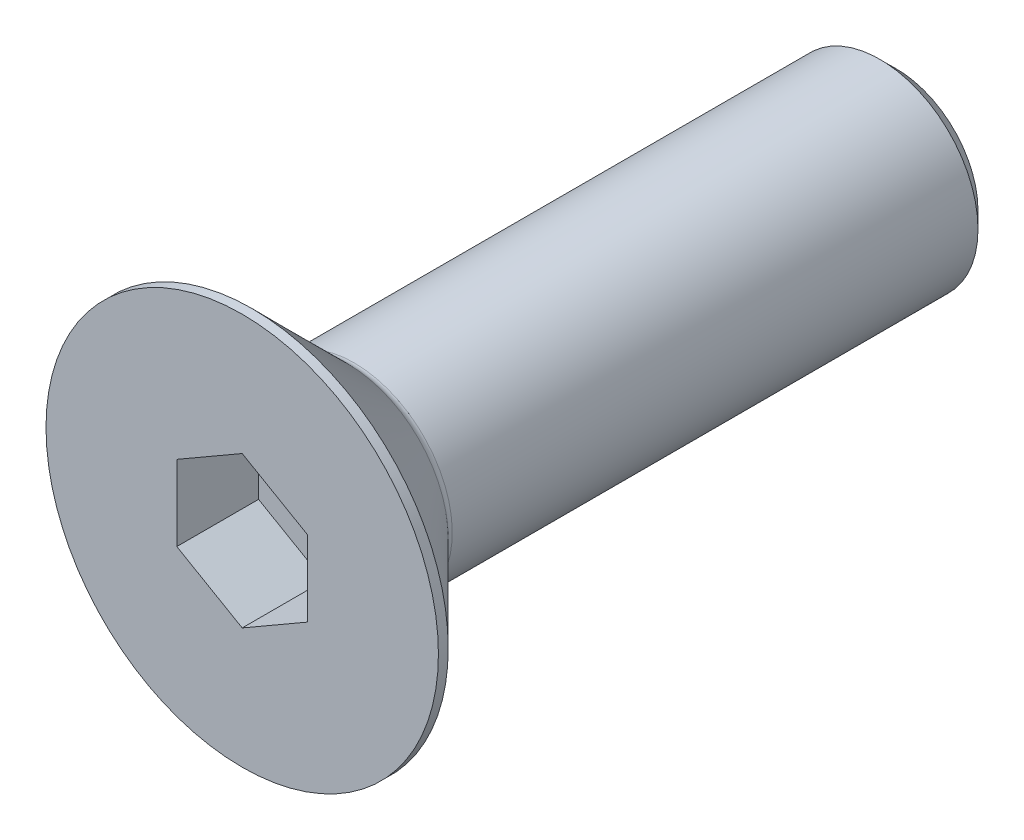
ISO-10303-21;
HEADER;
FILE_DESCRIPTION(('STEP AP214'),'2;1');
FILE_NAME('part.step','',(''),(''),'','','');
FILE_SCHEMA(('AUTOMOTIVE_DESIGN { 1 0 10303 214 1 1 1 1 }'));
ENDSEC;
DATA;
#1=APPLICATION_CONTEXT('core data for automotive mechanical design processes');
#2=APPLICATION_PROTOCOL_DEFINITION('international standard','automotive_design',2000,#1);
#3=PRODUCT_CONTEXT('',#1,'mechanical');
#4=PRODUCT('Part','Part','',(#3));
#5=PRODUCT_RELATED_PRODUCT_CATEGORY('part','',(#4));
#6=PRODUCT_DEFINITION_FORMATION('','',#4);
#7=PRODUCT_DEFINITION_CONTEXT('part definition',#1,'design');
#8=PRODUCT_DEFINITION('design','',#6,#7);
#9=PRODUCT_DEFINITION_SHAPE('','',#8);
#10=(LENGTH_UNIT() NAMED_UNIT(*) SI_UNIT(.MILLI.,.METRE.));
#11=(NAMED_UNIT(*) PLANE_ANGLE_UNIT() SI_UNIT($,.RADIAN.));
#12=(NAMED_UNIT(*) SI_UNIT($,.STERADIAN.) SOLID_ANGLE_UNIT());
#13=UNCERTAINTY_MEASURE_WITH_UNIT(LENGTH_MEASURE(1.E-05),#10,'distance_accuracy_value','');
#14=(GEOMETRIC_REPRESENTATION_CONTEXT(3) GLOBAL_UNCERTAINTY_ASSIGNED_CONTEXT((#13)) GLOBAL_UNIT_ASSIGNED_CONTEXT((#10,
#11,#12)) REPRESENTATION_CONTEXT('',''));
#15=CARTESIAN_POINT('',(0.,0.,0.));
#16=DIRECTION('',(0.,0.,1.));
#17=DIRECTION('',(1.,0.,0.));
#18=AXIS2_PLACEMENT_3D('',#15,#16,#17);
#19=CARTESIAN_POINT('',(0.,0.,-2.5));
#20=DIRECTION('',(0.,0.,1.));
#21=DIRECTION('',(1.,0.,0.));
#22=AXIS2_PLACEMENT_3D('',#19,#20,#21);
#23=PLANE('',#22);
#24=DIRECTION('',(-0.866025403784439,-0.5,0.));
#25=VECTOR('',#24,1.);
#26=CARTESIAN_POINT('',(0.,2.3094010767585,-2.5));
#27=LINE('',#26,#25);
#28=CARTESIAN_POINT('',(0.,2.3094010767585,-2.5));
#29=VERTEX_POINT('',#28);
#30=CARTESIAN_POINT('',(-2.,1.15470053837925,-2.5));
#31=VERTEX_POINT('',#30);
#32=EDGE_CURVE('E82',#29,#31,#27,.T.);
#33=ORIENTED_EDGE('',*,*,#32,.T.);
#34=DIRECTION('',(0.,1.,0.));
#35=VECTOR('',#34,1.);
#36=CARTESIAN_POINT('',(-2.,1.15470053837925,-2.5));
#37=LINE('',#36,#35);
#38=CARTESIAN_POINT('',(-2.,-1.15470053837925,-2.5));
#39=VERTEX_POINT('',#38);
#40=EDGE_CURVE('E66',#31,#39,#37,.F.);
#41=ORIENTED_EDGE('',*,*,#40,.T.);
#42=DIRECTION('',(0.866025403784439,-0.499999999999999,0.));
#43=VECTOR('',#42,1.);
#44=CARTESIAN_POINT('',(-2.,-1.15470053837925,-2.5));
#45=LINE('',#44,#43);
#46=CARTESIAN_POINT('',(0.,-2.3094010767585,-2.5));
#47=VERTEX_POINT('',#46);
#48=EDGE_CURVE('E71',#39,#47,#45,.T.);
#49=ORIENTED_EDGE('',*,*,#48,.T.);
#50=DIRECTION('',(0.866025403784439,0.5,0.));
#51=VECTOR('',#50,1.);
#52=CARTESIAN_POINT('',(0.,-2.3094010767585,-2.5));
#53=LINE('',#52,#51);
#54=CARTESIAN_POINT('',(2.,-1.15470053837925,-2.5));
#55=VERTEX_POINT('',#54);
#56=EDGE_CURVE('E128',#47,#55,#53,.T.);
#57=ORIENTED_EDGE('',*,*,#56,.T.);
#58=DIRECTION('',(0.,1.,0.));
#59=VECTOR('',#58,1.);
#60=CARTESIAN_POINT('',(2.,-1.15470053837925,-2.5));
#61=LINE('',#60,#59);
#62=CARTESIAN_POINT('',(2.,1.15470053837925,-2.5));
#63=VERTEX_POINT('',#62);
#64=EDGE_CURVE('E132',#55,#63,#61,.T.);
#65=ORIENTED_EDGE('',*,*,#64,.T.);
#66=DIRECTION('',(-0.866025403784439,0.499999999999999,0.));
#67=VECTOR('',#66,1.);
#68=CARTESIAN_POINT('',(2.,1.15470053837925,-2.5));
#69=LINE('',#68,#67);
#70=EDGE_CURVE('E137',#63,#29,#69,.T.);
#71=ORIENTED_EDGE('',*,*,#70,.T.);
#72=EDGE_LOOP('',(#33,#41,#49,#57,#65,#71));
#73=FACE_BOUND('',#72,.T.);
#74=ADVANCED_FACE('F15',(#73),#23,.T.);
#75=CARTESIAN_POINT('',(-2.,-1.15470053837925,0.));
#76=DIRECTION('',(-0.499999999999999,-0.866025403784439,0.));
#77=DIRECTION('',(0.866025403784439,-0.499999999999999,0.));
#78=AXIS2_PLACEMENT_3D('',#75,#76,#77);
#79=PLANE('',#78);
#80=DIRECTION('',(0.,0.,1.));
#81=VECTOR('',#80,1.);
#82=CARTESIAN_POINT('',(-2.,-1.15470053837925,0.));
#83=LINE('',#82,#81);
#84=CARTESIAN_POINT('',(-2.,-1.15470053837925,0.));
#85=VERTEX_POINT('',#84);
#86=EDGE_CURVE('E73',#39,#85,#83,.T.);
#87=ORIENTED_EDGE('',*,*,#86,.T.);
#88=DIRECTION('',(-0.866025403784439,0.499999999999999,0.));
#89=VECTOR('',#88,1.);
#90=CARTESIAN_POINT('',(0.,-2.3094010767585,0.));
#91=LINE('',#90,#89);
#92=CARTESIAN_POINT('',(0.,-2.3094010767585,0.));
#93=VERTEX_POINT('',#92);
#94=EDGE_CURVE('E126',#93,#85,#91,.T.);
#95=ORIENTED_EDGE('',*,*,#94,.F.);
#96=DIRECTION('',(0.,0.,1.));
#97=VECTOR('',#96,1.);
#98=CARTESIAN_POINT('',(0.,-2.3094010767585,0.));
#99=LINE('',#98,#97);
#100=EDGE_CURVE('E76',#93,#47,#99,.F.);
#101=ORIENTED_EDGE('',*,*,#100,.T.);
#102=ORIENTED_EDGE('',*,*,#48,.F.);
#103=EDGE_LOOP('',(#87,#95,#101,#102));
#104=FACE_BOUND('',#103,.T.);
#105=ADVANCED_FACE('F72',(#104),#79,.F.);
#106=CARTESIAN_POINT('',(-2.,1.15470053837925,0.));
#107=DIRECTION('',(-1.,0.,0.));
#108=DIRECTION('',(0.,0.,1.));
#109=AXIS2_PLACEMENT_3D('',#106,#107,#108);
#110=PLANE('',#109);
#111=DIRECTION('',(0.,0.,1.));
#112=VECTOR('',#111,1.);
#113=CARTESIAN_POINT('',(-2.,1.15470053837925,0.));
#114=LINE('',#113,#112);
#115=CARTESIAN_POINT('',(-2.,1.15470053837925,0.));
#116=VERTEX_POINT('',#115);
#117=EDGE_CURVE('E84',#31,#116,#114,.T.);
#118=ORIENTED_EDGE('',*,*,#117,.T.);
#119=DIRECTION('',(0.,1.,0.));
#120=VECTOR('',#119,1.);
#121=CARTESIAN_POINT('',(-2.,0.,0.));
#122=LINE('',#121,#120);
#123=EDGE_CURVE('E88',#85,#116,#122,.T.);
#124=ORIENTED_EDGE('',*,*,#123,.F.);
#125=ORIENTED_EDGE('',*,*,#86,.F.);
#126=ORIENTED_EDGE('',*,*,#40,.F.);
#127=EDGE_LOOP('',(#118,#124,#125,#126));
#128=FACE_BOUND('',#127,.T.);
#129=ADVANCED_FACE('F86',(#128),#110,.F.);
#130=CARTESIAN_POINT('',(0.,2.3094010767585,0.));
#131=DIRECTION('',(-0.5,0.866025403784439,0.));
#132=DIRECTION('',(-0.866025403784439,-0.5,0.));
#133=AXIS2_PLACEMENT_3D('',#130,#131,#132);
#134=PLANE('',#133);
#135=DIRECTION('',(0.,0.,1.));
#136=VECTOR('',#135,1.);
#137=CARTESIAN_POINT('',(0.,2.3094010767585,0.));
#138=LINE('',#137,#136);
#139=CARTESIAN_POINT('',(0.,2.3094010767585,0.));
#140=VERTEX_POINT('',#139);
#141=EDGE_CURVE('E139',#29,#140,#138,.T.);
#142=ORIENTED_EDGE('',*,*,#141,.T.);
#143=DIRECTION('',(0.866025403784439,0.5,0.));
#144=VECTOR('',#143,1.);
#145=CARTESIAN_POINT('',(-2.,1.15470053837925,0.));
#146=LINE('',#145,#144);
#147=EDGE_CURVE('E122',#116,#140,#146,.T.);
#148=ORIENTED_EDGE('',*,*,#147,.F.);
#149=ORIENTED_EDGE('',*,*,#117,.F.);
#150=ORIENTED_EDGE('',*,*,#32,.F.);
#151=EDGE_LOOP('',(#142,#148,#149,#150));
#152=FACE_BOUND('',#151,.T.);
#153=ADVANCED_FACE('F143',(#152),#134,.F.);
#154=CARTESIAN_POINT('',(2.,1.15470053837925,0.));
#155=DIRECTION('',(0.499999999999999,0.866025403784439,0.));
#156=DIRECTION('',(-0.866025403784439,0.499999999999999,0.));
#157=AXIS2_PLACEMENT_3D('',#154,#155,#156);
#158=PLANE('',#157);
#159=DIRECTION('',(0.,0.,-1.));
#160=VECTOR('',#159,1.);
#161=CARTESIAN_POINT('',(2.,1.15470053837925,0.));
#162=LINE('',#161,#160);
#163=CARTESIAN_POINT('',(2.,1.15470053837925,0.));
#164=VERTEX_POINT('',#163);
#165=EDGE_CURVE('E135',#63,#164,#162,.F.);
#166=ORIENTED_EDGE('',*,*,#165,.T.);
#167=DIRECTION('',(0.866025403784439,-0.499999999999999,0.));
#168=VECTOR('',#167,1.);
#169=CARTESIAN_POINT('',(0.,2.3094010767585,0.));
#170=LINE('',#169,#168);
#171=EDGE_CURVE('E119',#140,#164,#170,.T.);
#172=ORIENTED_EDGE('',*,*,#171,.F.);
#173=ORIENTED_EDGE('',*,*,#141,.F.);
#174=ORIENTED_EDGE('',*,*,#70,.F.);
#175=EDGE_LOOP('',(#166,#172,#173,#174));
#176=FACE_BOUND('',#175,.T.);
#177=ADVANCED_FACE('F154',(#176),#158,.F.);
#178=CARTESIAN_POINT('',(2.,-1.15470053837925,0.));
#179=DIRECTION('',(1.,0.,0.));
#180=DIRECTION('',(0.,0.,-1.));
#181=AXIS2_PLACEMENT_3D('',#178,#179,#180);
#182=PLANE('',#181);
#183=DIRECTION('',(0.,0.,1.));
#184=VECTOR('',#183,1.);
#185=CARTESIAN_POINT('',(2.,-1.15470053837925,0.));
#186=LINE('',#185,#184);
#187=CARTESIAN_POINT('',(2.,-1.15470053837925,0.));
#188=VERTEX_POINT('',#187);
#189=EDGE_CURVE('E34',#55,#188,#186,.T.);
#190=ORIENTED_EDGE('',*,*,#189,.T.);
#191=DIRECTION('',(0.,1.,0.));
#192=VECTOR('',#191,1.);
#193=CARTESIAN_POINT('',(2.,0.,0.));
#194=LINE('',#193,#192);
#195=EDGE_CURVE('E116',#164,#188,#194,.F.);
#196=ORIENTED_EDGE('',*,*,#195,.F.);
#197=ORIENTED_EDGE('',*,*,#165,.F.);
#198=ORIENTED_EDGE('',*,*,#64,.F.);
#199=EDGE_LOOP('',(#190,#196,#197,#198));
#200=FACE_BOUND('',#199,.T.);
#201=ADVANCED_FACE('F152',(#200),#182,.F.);
#202=CARTESIAN_POINT('',(0.,-2.3094010767585,0.));
#203=DIRECTION('',(0.5,-0.866025403784439,0.));
#204=DIRECTION('',(0.866025403784439,0.5,0.));
#205=AXIS2_PLACEMENT_3D('',#202,#203,#204);
#206=PLANE('',#205);
#207=ORIENTED_EDGE('',*,*,#100,.F.);
#208=DIRECTION('',(-0.866025403784439,-0.5,0.));
#209=VECTOR('',#208,1.);
#210=CARTESIAN_POINT('',(2.,-1.15470053837925,0.));
#211=LINE('',#210,#209);
#212=EDGE_CURVE('E113',#188,#93,#211,.T.);
#213=ORIENTED_EDGE('',*,*,#212,.F.);
#214=ORIENTED_EDGE('',*,*,#189,.F.);
#215=ORIENTED_EDGE('',*,*,#56,.F.);
#216=EDGE_LOOP('',(#207,#213,#214,#215));
#217=FACE_BOUND('',#216,.T.);
#218=ADVANCED_FACE('F150',(#217),#206,.F.);
#219=CARTESIAN_POINT('',(3.,0.,0.));
#220=DIRECTION('',(0.,0.,1.));
#221=DIRECTION('',(1.,0.,0.));
#222=AXIS2_PLACEMENT_3D('',#219,#220,#221);
#223=PLANE('',#222);
#224=ORIENTED_EDGE('',*,*,#195,.T.);
#225=ORIENTED_EDGE('',*,*,#212,.T.);
#226=ORIENTED_EDGE('',*,*,#94,.T.);
#227=ORIENTED_EDGE('',*,*,#123,.T.);
#228=ORIENTED_EDGE('',*,*,#147,.T.);
#229=ORIENTED_EDGE('',*,*,#171,.T.);
#230=EDGE_LOOP('',(#224,#225,#226,#227,#228,#229));
#231=FACE_BOUND('',#230,.T.);
#232=CARTESIAN_POINT('',(0.,0.,0.));
#233=DIRECTION('',(0.,0.,-1.));
#234=DIRECTION('',(-1.,0.,0.));
#235=AXIS2_PLACEMENT_3D('',#232,#233,#234);
#236=CIRCLE('',#235,6.);
#237=CARTESIAN_POINT('',(-6.,0.,0.));
#238=VERTEX_POINT('',#237);
#239=EDGE_CURVE('E19',#238,#238,#236,.T.);
#240=ORIENTED_EDGE('',*,*,#239,.F.);
#241=EDGE_LOOP('',(#240));
#242=FACE_BOUND('',#241,.T.);
#243=ADVANCED_FACE('F147',(#231,#242),#223,.T.);
#244=CARTESIAN_POINT('',(0.,0.,-0.150000000000001));
#245=DIRECTION('',(0.,0.,-1.));
#246=DIRECTION('',(-1.,0.,0.));
#247=AXIS2_PLACEMENT_3D('',#244,#245,#246);
#248=CYLINDRICAL_SURFACE('',#247,6.);
#249=ORIENTED_EDGE('',*,*,#239,.T.);
#250=EDGE_LOOP('',(#249));
#251=FACE_BOUND('',#250,.T.);
#252=CARTESIAN_POINT('',(0.,0.,-0.299999998617295));
#253=DIRECTION('',(0.,0.,1.));
#254=DIRECTION('',(1.,0.,0.));
#255=AXIS2_PLACEMENT_3D('',#252,#253,#254);
#256=CIRCLE('',#255,5.99999999872125);
#257=CARTESIAN_POINT('',(5.99999999872125,0.,-0.299999998617295));
#258=VERTEX_POINT('',#257);
#259=EDGE_CURVE('E100',#258,#258,#256,.F.);
#260=ORIENTED_EDGE('',*,*,#259,.F.);
#261=EDGE_LOOP('',(#260));
#262=FACE_BOUND('',#261,.T.);
#263=ADVANCED_FACE('F183',(#251,#262),#248,.T.);
#264=CARTESIAN_POINT('',(0.,0.,-0.299999998617295));
#265=DIRECTION('',(0.,0.,1.));
#266=DIRECTION('',(1.,0.,0.));
#267=AXIS2_PLACEMENT_3D('',#264,#265,#266);
#268=CONICAL_SURFACE('',#267,5.99999999872125,0.78539816249955);
#269=CARTESIAN_POINT('',(0.,0.,-3.21213203435597));
#270=DIRECTION('',(0.,0.,-1.));
#271=DIRECTION('',(0.,1.,0.));
#272=AXIS2_PLACEMENT_3D('',#269,#270,#271);
#273=CIRCLE('',#272,3.08786796564404);
#274=CARTESIAN_POINT('',(0.,3.08786796564404,-3.21213203435597));
#275=VERTEX_POINT('',#274);
#276=EDGE_CURVE('E94',#275,#275,#273,.T.);
#277=ORIENTED_EDGE('',*,*,#276,.F.);
#278=EDGE_LOOP('',(#277));
#279=FACE_BOUND('',#278,.T.);
#280=ORIENTED_EDGE('',*,*,#259,.T.);
#281=EDGE_LOOP('',(#280));
#282=FACE_BOUND('',#281,.T.);
#283=ADVANCED_FACE('F179',(#279,#282),#268,.T.);
#284=CARTESIAN_POINT('',(1.5,0.,-20.));
#285=DIRECTION('',(0.,0.,-1.));
#286=DIRECTION('',(-1.,0.,0.));
#287=AXIS2_PLACEMENT_3D('',#284,#285,#286);
#288=PLANE('',#287);
#289=CARTESIAN_POINT('',(0.,0.,-20.0000000002092));
#290=DIRECTION('',(0.,0.,1.));
#291=DIRECTION('',(1.,0.,0.));
#292=AXIS2_PLACEMENT_3D('',#289,#290,#291);
#293=CIRCLE('',#292,2.5000000002251);
#294=CARTESIAN_POINT('',(2.5000000002251,0.,-20.0000000002092));
#295=VERTEX_POINT('',#294);
#296=EDGE_CURVE('E92',#295,#295,#293,.T.);
#297=ORIENTED_EDGE('',*,*,#296,.F.);
#298=EDGE_LOOP('',(#297));
#299=FACE_BOUND('',#298,.T.);
#300=ADVANCED_FACE('F176',(#299),#288,.T.);
#301=CARTESIAN_POINT('',(0.,0.,-3.42426406871193));
#302=DIRECTION('',(0.,0.,-1.));
#303=DIRECTION('',(0.,1.,0.));
#304=AXIS2_PLACEMENT_3D('',#301,#302,#303);
#305=TOROIDAL_SURFACE('',#304,3.3,0.3);
#306=CARTESIAN_POINT('',(0.,0.,-3.42426406871193));
#307=DIRECTION('',(0.,0.,-1.));
#308=DIRECTION('',(-1.,0.,0.));
#309=AXIS2_PLACEMENT_3D('',#306,#307,#308);
#310=CIRCLE('',#309,3.);
#311=CARTESIAN_POINT('',(-3.,0.,-3.42426406871193));
#312=VERTEX_POINT('',#311);
#313=EDGE_CURVE('E25',#312,#312,#310,.T.);
#314=ORIENTED_EDGE('',*,*,#313,.F.);
#315=EDGE_LOOP('',(#314));
#316=FACE_BOUND('',#315,.T.);
#317=ORIENTED_EDGE('',*,*,#276,.T.);
#318=EDGE_LOOP('',(#317));
#319=FACE_BOUND('',#318,.T.);
#320=ADVANCED_FACE('F17',(#316,#319),#305,.F.);
#321=CARTESIAN_POINT('',(0.,0.,-19.4999999997663));
#322=DIRECTION('',(0.,0.,1.));
#323=DIRECTION('',(1.,0.,0.));
#324=AXIS2_PLACEMENT_3D('',#321,#322,#323);
#325=CONICAL_SURFACE('',#324,2.99999999975853,0.785398162487954);
#326=ORIENTED_EDGE('',*,*,#296,.T.);
#327=EDGE_LOOP('',(#326));
#328=FACE_BOUND('',#327,.T.);
#329=CARTESIAN_POINT('',(0.,0.,-19.5));
#330=DIRECTION('',(0.,0.,-1.));
#331=DIRECTION('',(-1.,0.,0.));
#332=AXIS2_PLACEMENT_3D('',#329,#330,#331);
#333=CIRCLE('',#332,3.);
#334=CARTESIAN_POINT('',(-3.,0.,-19.5));
#335=VERTEX_POINT('',#334);
#336=EDGE_CURVE('E10',#335,#335,#333,.F.);
#337=ORIENTED_EDGE('',*,*,#336,.F.);
#338=EDGE_LOOP('',(#337));
#339=FACE_BOUND('',#338,.T.);
#340=ADVANCED_FACE('F166',(#328,#339),#325,.T.);
#341=CARTESIAN_POINT('',(0.,0.,-11.65));
#342=DIRECTION('',(0.,0.,-1.));
#343=DIRECTION('',(-1.,0.,0.));
#344=AXIS2_PLACEMENT_3D('',#341,#342,#343);
#345=CYLINDRICAL_SURFACE('',#344,3.);
#346=ORIENTED_EDGE('',*,*,#336,.T.);
#347=EDGE_LOOP('',(#346));
#348=FACE_BOUND('',#347,.T.);
#349=ORIENTED_EDGE('',*,*,#313,.T.);
#350=EDGE_LOOP('',(#349));
#351=FACE_BOUND('',#350,.T.);
#352=ADVANCED_FACE('F164',(#348,#351),#345,.T.);
#353=CLOSED_SHELL('',(#74,#105,#129,#153,#177,#201,#218,#243,#263,#283,#300,#320,#340,#352));
#354=MANIFOLD_SOLID_BREP('B1',#353);
#355=ADVANCED_BREP_SHAPE_REPRESENTATION('',(#18,#354),#14);
#356=SHAPE_DEFINITION_REPRESENTATION(#9,#355);
ENDSEC;
END-ISO-10303-21;
